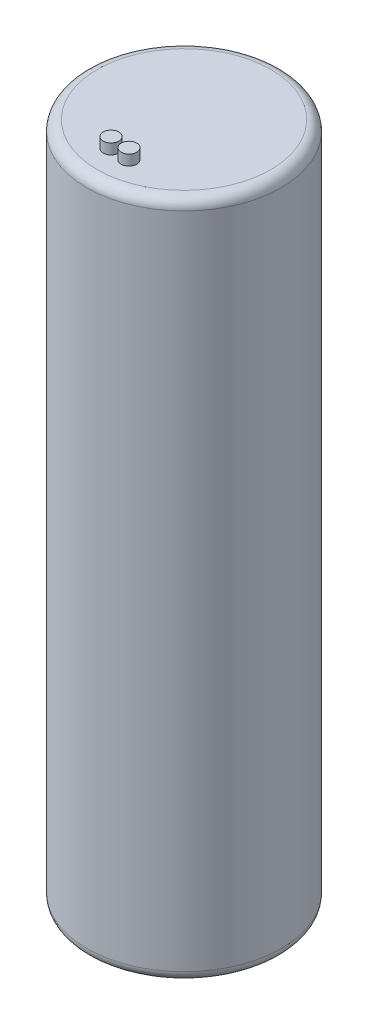
ISO-10303-21;
HEADER;
FILE_DESCRIPTION(('STEP AP214'),'2;1');
FILE_NAME('part.step','',(''),(''),'','','');
FILE_SCHEMA(('AUTOMOTIVE_DESIGN { 1 0 10303 214 1 1 1 1 }'));
ENDSEC;
DATA;
#1=APPLICATION_CONTEXT('core data for automotive mechanical design processes');
#2=APPLICATION_PROTOCOL_DEFINITION('international standard','automotive_design',2000,#1);
#3=PRODUCT_CONTEXT('',#1,'mechanical');
#4=PRODUCT('Part','Part','',(#3));
#5=PRODUCT_RELATED_PRODUCT_CATEGORY('part','',(#4));
#6=PRODUCT_DEFINITION_FORMATION('','',#4);
#7=PRODUCT_DEFINITION_CONTEXT('part definition',#1,'design');
#8=PRODUCT_DEFINITION('design','',#6,#7);
#9=PRODUCT_DEFINITION_SHAPE('','',#8);
#10=(LENGTH_UNIT() NAMED_UNIT(*) SI_UNIT(.MILLI.,.METRE.));
#11=(NAMED_UNIT(*) PLANE_ANGLE_UNIT() SI_UNIT($,.RADIAN.));
#12=(NAMED_UNIT(*) SI_UNIT($,.STERADIAN.) SOLID_ANGLE_UNIT());
#13=UNCERTAINTY_MEASURE_WITH_UNIT(LENGTH_MEASURE(1.E-05),#10,'distance_accuracy_value','');
#14=(GEOMETRIC_REPRESENTATION_CONTEXT(3) GLOBAL_UNCERTAINTY_ASSIGNED_CONTEXT((#13)) GLOBAL_UNIT_ASSIGNED_CONTEXT((#10,
#11,#12)) REPRESENTATION_CONTEXT('',''));
#15=CARTESIAN_POINT('',(0.,0.,0.));
#16=DIRECTION('',(0.,0.,1.));
#17=DIRECTION('',(1.,0.,0.));
#18=AXIS2_PLACEMENT_3D('',#15,#16,#17);
#19=CARTESIAN_POINT('',(0.,65.,0.));
#20=DIRECTION('',(0.,-1.,0.));
#21=DIRECTION('',(0.,0.,-1.));
#22=AXIS2_PLACEMENT_3D('',#19,#20,#21);
#23=CYLINDRICAL_SURFACE('',#22,9.3);
#24=CARTESIAN_POINT('',(0.,64.,0.));
#25=DIRECTION('',(0.,1.,0.));
#26=DIRECTION('',(0.,0.,1.));
#27=AXIS2_PLACEMENT_3D('',#24,#25,#26);
#28=CIRCLE('',#27,9.3);
#29=CARTESIAN_POINT('',(0.,64.,9.3));
#30=VERTEX_POINT('',#29);
#31=EDGE_CURVE('E47',#30,#30,#28,.F.);
#32=ORIENTED_EDGE('',*,*,#31,.T.);
#33=EDGE_LOOP('',(#32));
#34=FACE_BOUND('',#33,.T.);
#35=CARTESIAN_POINT('',(0.,1.,0.));
#36=DIRECTION('',(0.,1.,0.));
#37=DIRECTION('',(0.,0.,1.));
#38=AXIS2_PLACEMENT_3D('',#35,#36,#37);
#39=CIRCLE('',#38,9.3);
#40=CARTESIAN_POINT('',(0.,1.,9.3));
#41=VERTEX_POINT('',#40);
#42=EDGE_CURVE('E52',#41,#41,#39,.T.);
#43=ORIENTED_EDGE('',*,*,#42,.T.);
#44=EDGE_LOOP('',(#43));
#45=FACE_BOUND('',#44,.T.);
#46=ADVANCED_FACE('F39',(#34,#45),#23,.T.);
#47=CARTESIAN_POINT('',(0.,65.,0.));
#48=DIRECTION('',(0.,1.,0.));
#49=DIRECTION('',(0.,0.,1.));
#50=AXIS2_PLACEMENT_3D('',#47,#48,#49);
#51=PLANE('',#50);
#52=CARTESIAN_POINT('',(0.694041569293525,65.,5.95972367648808));
#53=DIRECTION('',(0.,1.,0.));
#54=DIRECTION('',(0.,0.,1.));
#55=AXIS2_PLACEMENT_3D('',#52,#53,#54);
#56=CIRCLE('',#55,0.75);
#57=CARTESIAN_POINT('',(0.694041569293525,65.,6.70972367648808));
#58=VERTEX_POINT('',#57);
#59=EDGE_CURVE('E72',#58,#58,#56,.T.);
#60=ORIENTED_EDGE('',*,*,#59,.F.);
#61=EDGE_LOOP('',(#60));
#62=FACE_BOUND('',#61,.T.);
#63=CARTESIAN_POINT('',(-1.0890571682258,65.,5.90033511627399));
#64=DIRECTION('',(0.,1.,0.));
#65=DIRECTION('',(0.,0.,1.));
#66=AXIS2_PLACEMENT_3D('',#63,#64,#65);
#67=CIRCLE('',#66,0.75);
#68=CARTESIAN_POINT('',(-1.0890571682258,65.,6.65033511627399));
#69=VERTEX_POINT('',#68);
#70=EDGE_CURVE('E64',#69,#69,#67,.T.);
#71=ORIENTED_EDGE('',*,*,#70,.F.);
#72=EDGE_LOOP('',(#71));
#73=FACE_BOUND('',#72,.T.);
#74=CARTESIAN_POINT('',(0.,65.,0.));
#75=DIRECTION('',(0.,1.,0.));
#76=DIRECTION('',(0.,0.,1.));
#77=AXIS2_PLACEMENT_3D('',#74,#75,#76);
#78=CIRCLE('',#77,8.3);
#79=CARTESIAN_POINT('',(0.,65.,8.3));
#80=VERTEX_POINT('',#79);
#81=EDGE_CURVE('E57',#80,#80,#78,.T.);
#82=ORIENTED_EDGE('',*,*,#81,.T.);
#83=EDGE_LOOP('',(#82));
#84=FACE_BOUND('',#83,.T.);
#85=ADVANCED_FACE('F89',(#62,#73,#84),#51,.T.);
#86=CARTESIAN_POINT('',(0.,0.,0.));
#87=DIRECTION('',(0.,1.,0.));
#88=DIRECTION('',(0.,0.,1.));
#89=AXIS2_PLACEMENT_3D('',#86,#87,#88);
#90=PLANE('',#89);
#91=CARTESIAN_POINT('',(0.,0.,0.));
#92=DIRECTION('',(0.,1.,0.));
#93=DIRECTION('',(0.,0.,1.));
#94=AXIS2_PLACEMENT_3D('',#91,#92,#93);
#95=CIRCLE('',#94,8.3);
#96=CARTESIAN_POINT('',(0.,0.,8.3));
#97=VERTEX_POINT('',#96);
#98=EDGE_CURVE('E10',#97,#97,#95,.F.);
#99=ORIENTED_EDGE('',*,*,#98,.T.);
#100=EDGE_LOOP('',(#99));
#101=FACE_BOUND('',#100,.T.);
#102=ADVANCED_FACE('F92',(#101),#90,.F.);
#103=CARTESIAN_POINT('',(0.,64.,0.));
#104=DIRECTION('',(0.,1.,0.));
#105=DIRECTION('',(0.,0.,1.));
#106=AXIS2_PLACEMENT_3D('',#103,#104,#105);
#107=TOROIDAL_SURFACE('',#106,8.3,1.);
#108=ORIENTED_EDGE('',*,*,#31,.F.);
#109=EDGE_LOOP('',(#108));
#110=FACE_BOUND('',#109,.T.);
#111=ORIENTED_EDGE('',*,*,#81,.F.);
#112=EDGE_LOOP('',(#111));
#113=FACE_BOUND('',#112,.T.);
#114=ADVANCED_FACE('F98',(#110,#113),#107,.T.);
#115=CARTESIAN_POINT('',(0.,1.,0.));
#116=DIRECTION('',(0.,1.,0.));
#117=DIRECTION('',(0.,0.,1.));
#118=AXIS2_PLACEMENT_3D('',#115,#116,#117);
#119=TOROIDAL_SURFACE('',#118,8.3,1.);
#120=ORIENTED_EDGE('',*,*,#98,.F.);
#121=EDGE_LOOP('',(#120));
#122=FACE_BOUND('',#121,.T.);
#123=ORIENTED_EDGE('',*,*,#42,.F.);
#124=EDGE_LOOP('',(#123));
#125=FACE_BOUND('',#124,.T.);
#126=ADVANCED_FACE('F41',(#122,#125),#119,.T.);
#127=CARTESIAN_POINT('',(-1.0890571682258,66.,5.90033511627399));
#128=DIRECTION('',(0.,-1.,0.));
#129=DIRECTION('',(0.,0.,-1.));
#130=AXIS2_PLACEMENT_3D('',#127,#128,#129);
#131=CYLINDRICAL_SURFACE('',#130,0.75);
#132=CARTESIAN_POINT('',(-1.0890571682258,66.,5.90033511627399));
#133=DIRECTION('',(0.,1.,0.));
#134=DIRECTION('',(0.,0.,1.));
#135=AXIS2_PLACEMENT_3D('',#132,#133,#134);
#136=CIRCLE('',#135,0.75);
#137=CARTESIAN_POINT('',(-1.0890571682258,66.,6.65033511627399));
#138=VERTEX_POINT('',#137);
#139=EDGE_CURVE('E63',#138,#138,#136,.T.);
#140=ORIENTED_EDGE('',*,*,#139,.F.);
#141=EDGE_LOOP('',(#140));
#142=FACE_BOUND('',#141,.T.);
#143=ORIENTED_EDGE('',*,*,#70,.T.);
#144=EDGE_LOOP('',(#143));
#145=FACE_BOUND('',#144,.T.);
#146=ADVANCED_FACE('F105',(#142,#145),#131,.T.);
#147=CARTESIAN_POINT('',(-1.0890571682258,66.,5.90033511627399));
#148=DIRECTION('',(0.,1.,0.));
#149=DIRECTION('',(0.,0.,1.));
#150=AXIS2_PLACEMENT_3D('',#147,#148,#149);
#151=PLANE('',#150);
#152=ORIENTED_EDGE('',*,*,#139,.T.);
#153=EDGE_LOOP('',(#152));
#154=FACE_BOUND('',#153,.T.);
#155=ADVANCED_FACE('F85',(#154),#151,.T.);
#156=CARTESIAN_POINT('',(0.694041569293525,66.,5.95972367648808));
#157=DIRECTION('',(0.,-1.,0.));
#158=DIRECTION('',(0.,0.,-1.));
#159=AXIS2_PLACEMENT_3D('',#156,#157,#158);
#160=CYLINDRICAL_SURFACE('',#159,0.75);
#161=CARTESIAN_POINT('',(0.694041569293525,66.,5.95972367648808));
#162=DIRECTION('',(0.,1.,0.));
#163=DIRECTION('',(0.,0.,1.));
#164=AXIS2_PLACEMENT_3D('',#161,#162,#163);
#165=CIRCLE('',#164,0.75);
#166=CARTESIAN_POINT('',(0.694041569293525,66.,6.70972367648808));
#167=VERTEX_POINT('',#166);
#168=EDGE_CURVE('E68',#167,#167,#165,.T.);
#169=ORIENTED_EDGE('',*,*,#168,.F.);
#170=EDGE_LOOP('',(#169));
#171=FACE_BOUND('',#170,.T.);
#172=ORIENTED_EDGE('',*,*,#59,.T.);
#173=EDGE_LOOP('',(#172));
#174=FACE_BOUND('',#173,.T.);
#175=ADVANCED_FACE('F82',(#171,#174),#160,.T.);
#176=CARTESIAN_POINT('',(0.694041569293525,66.,5.95972367648808));
#177=DIRECTION('',(0.,1.,0.));
#178=DIRECTION('',(0.,0.,1.));
#179=AXIS2_PLACEMENT_3D('',#176,#177,#178);
#180=PLANE('',#179);
#181=ORIENTED_EDGE('',*,*,#168,.T.);
#182=EDGE_LOOP('',(#181));
#183=FACE_BOUND('',#182,.T.);
#184=ADVANCED_FACE('F80',(#183),#180,.T.);
#185=CLOSED_SHELL('',(#46,#85,#102,#114,#126,#146,#155,#175,#184));
#186=MANIFOLD_SOLID_BREP('B2',#185);
#187=ADVANCED_BREP_SHAPE_REPRESENTATION('',(#18,#186),#14);
#188=SHAPE_DEFINITION_REPRESENTATION(#9,#187);
ENDSEC;
END-ISO-10303-21;
